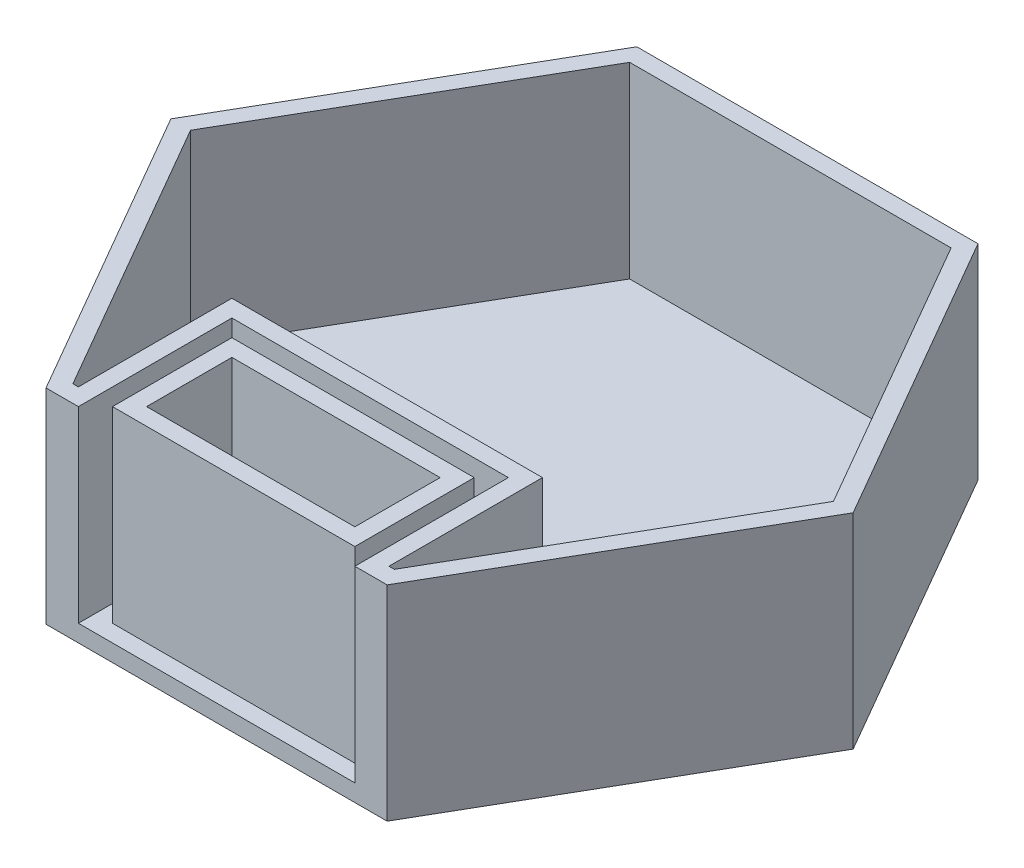
ISO-10303-21;
HEADER;
FILE_DESCRIPTION(('STEP AP214'),'2;1');
FILE_NAME('part.step','',(''),(''),'','','');
FILE_SCHEMA(('AUTOMOTIVE_DESIGN { 1 0 10303 214 1 1 1 1 }'));
ENDSEC;
DATA;
#1=APPLICATION_CONTEXT('core data for automotive mechanical design processes');
#2=APPLICATION_PROTOCOL_DEFINITION('international standard','automotive_design',2000,#1);
#3=PRODUCT_CONTEXT('',#1,'mechanical');
#4=PRODUCT('Part','Part','',(#3));
#5=PRODUCT_RELATED_PRODUCT_CATEGORY('part','',(#4));
#6=PRODUCT_DEFINITION_FORMATION('','',#4);
#7=PRODUCT_DEFINITION_CONTEXT('part definition',#1,'design');
#8=PRODUCT_DEFINITION('design','',#6,#7);
#9=PRODUCT_DEFINITION_SHAPE('','',#8);
#10=(LENGTH_UNIT() NAMED_UNIT(*) SI_UNIT(.MILLI.,.METRE.));
#11=(NAMED_UNIT(*) PLANE_ANGLE_UNIT() SI_UNIT($,.RADIAN.));
#12=(NAMED_UNIT(*) SI_UNIT($,.STERADIAN.) SOLID_ANGLE_UNIT());
#13=UNCERTAINTY_MEASURE_WITH_UNIT(LENGTH_MEASURE(1.E-05),#10,'distance_accuracy_value','');
#14=(GEOMETRIC_REPRESENTATION_CONTEXT(3) GLOBAL_UNCERTAINTY_ASSIGNED_CONTEXT((#13)) GLOBAL_UNIT_ASSIGNED_CONTEXT((#10,
#11,#12)) REPRESENTATION_CONTEXT('',''));
#15=CARTESIAN_POINT('',(0.,0.,0.));
#16=DIRECTION('',(0.,0.,1.));
#17=DIRECTION('',(1.,0.,0.));
#18=AXIS2_PLACEMENT_3D('',#15,#16,#17);
#19=CARTESIAN_POINT('',(0.,2.54,0.));
#20=DIRECTION('',(0.,1.,0.));
#21=DIRECTION('',(0.,0.,1.));
#22=AXIS2_PLACEMENT_3D('',#19,#20,#21);
#23=PLANE('',#22);
#24=DIRECTION('',(0.,0.,-1.));
#25=VECTOR('',#24,1.);
#26=CARTESIAN_POINT('',(30.2211146594323,2.54,0.));
#27=LINE('',#26,#25);
#28=CARTESIAN_POINT('',(30.2211146594323,2.54000000000001,0.));
#29=VERTEX_POINT('',#28);
#30=CARTESIAN_POINT('',(30.2211146594323,2.54,-22.86));
#31=VERTEX_POINT('',#30);
#32=EDGE_CURVE('E405',#29,#31,#27,.T.);
#33=ORIENTED_EDGE('',*,*,#32,.F.);
#34=DIRECTION('',(1.,0.,0.));
#35=VECTOR('',#34,1.);
#36=CARTESIAN_POINT('',(25.4,2.54,0.));
#37=LINE('',#36,#35);
#38=CARTESIAN_POINT('',(71.3907640755157,2.54,0.));
#39=VERTEX_POINT('',#38);
#40=EDGE_CURVE('E473',#29,#39,#37,.T.);
#41=ORIENTED_EDGE('',*,*,#40,.T.);
#42=DIRECTION('',(0.,0.,-1.));
#43=VECTOR('',#42,1.);
#44=CARTESIAN_POINT('',(71.3907640755157,2.54,0.));
#45=LINE('',#44,#43);
#46=CARTESIAN_POINT('',(71.3907640755157,2.54,-22.86));
#47=VERTEX_POINT('',#46);
#48=EDGE_CURVE('E97',#39,#47,#45,.T.);
#49=ORIENTED_EDGE('',*,*,#48,.T.);
#50=DIRECTION('',(-1.,0.,0.));
#51=VECTOR('',#50,1.);
#52=CARTESIAN_POINT('',(0.,2.54,-22.86));
#53=LINE('',#52,#51);
#54=EDGE_CURVE('E92',#47,#31,#53,.T.);
#55=ORIENTED_EDGE('',*,*,#54,.T.);
#56=EDGE_LOOP('',(#33,#41,#49,#55));
#57=FACE_BOUND('',#56,.T.);
#58=DIRECTION('',(-1.,0.,0.));
#59=VECTOR('',#58,1.);
#60=CARTESIAN_POINT('',(0.,2.54,-20.32));
#61=LINE('',#60,#59);
#62=CARTESIAN_POINT('',(68.8507640755157,2.54000000000001,-20.32));
#63=VERTEX_POINT('',#62);
#64=CARTESIAN_POINT('',(32.7611146594323,2.54,-20.32));
#65=VERTEX_POINT('',#64);
#66=EDGE_CURVE('E462',#63,#65,#61,.T.);
#67=ORIENTED_EDGE('',*,*,#66,.F.);
#68=DIRECTION('',(0.,0.,-1.));
#69=VECTOR('',#68,1.);
#70=CARTESIAN_POINT('',(68.8507640755157,2.54,0.));
#71=LINE('',#70,#69);
#72=CARTESIAN_POINT('',(68.8507640755157,2.54,-2.54));
#73=VERTEX_POINT('',#72);
#74=EDGE_CURVE('E455',#73,#63,#71,.T.);
#75=ORIENTED_EDGE('',*,*,#74,.F.);
#76=DIRECTION('',(-1.,0.,0.));
#77=VECTOR('',#76,1.);
#78=CARTESIAN_POINT('',(0.,2.54,-2.54));
#79=LINE('',#78,#77);
#80=CARTESIAN_POINT('',(32.7611146594323,2.54,-2.54));
#81=VERTEX_POINT('',#80);
#82=EDGE_CURVE('E458',#73,#81,#79,.T.);
#83=ORIENTED_EDGE('',*,*,#82,.T.);
#84=DIRECTION('',(0.,0.,-1.));
#85=VECTOR('',#84,1.);
#86=CARTESIAN_POINT('',(32.7611146594323,2.54,0.));
#87=LINE('',#86,#85);
#88=EDGE_CURVE('E460',#81,#65,#87,.T.);
#89=ORIENTED_EDGE('',*,*,#88,.T.);
#90=EDGE_LOOP('',(#67,#75,#83,#89));
#91=FACE_BOUND('',#90,.T.);
#92=ADVANCED_FACE('F77',(#57,#91),#23,.T.);
#93=CARTESIAN_POINT('',(25.4,2.54,0.));
#94=DIRECTION('',(0.,0.,-1.));
#95=DIRECTION('',(-1.,0.,0.));
#96=AXIS2_PLACEMENT_3D('',#93,#94,#95);
#97=PLANE('',#96);
#98=DIRECTION('',(0.,-1.,0.));
#99=VECTOR('',#98,1.);
#100=CARTESIAN_POINT('',(76.2,2.54,0.));
#101=LINE('',#100,#99);
#102=CARTESIAN_POINT('',(76.2,30.48,0.));
#103=VERTEX_POINT('',#102);
#104=CARTESIAN_POINT('',(76.2,0.,0.));
#105=VERTEX_POINT('',#104);
#106=EDGE_CURVE('E12',#103,#105,#101,.T.);
#107=ORIENTED_EDGE('',*,*,#106,.F.);
#108=DIRECTION('',(1.,0.,0.));
#109=VECTOR('',#108,1.);
#110=CARTESIAN_POINT('',(0.,30.48,0.));
#111=LINE('',#110,#109);
#112=CARTESIAN_POINT('',(71.3907640755157,30.48,0.));
#113=VERTEX_POINT('',#112);
#114=EDGE_CURVE('E320',#113,#103,#111,.T.);
#115=ORIENTED_EDGE('',*,*,#114,.F.);
#116=DIRECTION('',(0.,-1.,0.));
#117=VECTOR('',#116,1.);
#118=CARTESIAN_POINT('',(71.3907640755157,30.48,0.));
#119=LINE('',#118,#117);
#120=EDGE_CURVE('E344',#113,#39,#119,.T.);
#121=ORIENTED_EDGE('',*,*,#120,.T.);
#122=ORIENTED_EDGE('',*,*,#40,.F.);
#123=DIRECTION('',(0.,-1.,0.));
#124=VECTOR('',#123,1.);
#125=CARTESIAN_POINT('',(30.2211146594323,30.48,0.));
#126=LINE('',#125,#124);
#127=CARTESIAN_POINT('',(30.2211146594323,30.48,0.));
#128=VERTEX_POINT('',#127);
#129=EDGE_CURVE('E272',#128,#29,#126,.T.);
#130=ORIENTED_EDGE('',*,*,#129,.F.);
#131=DIRECTION('',(-1.,0.,0.));
#132=VECTOR('',#131,1.);
#133=CARTESIAN_POINT('',(0.,30.48,0.));
#134=LINE('',#133,#132);
#135=CARTESIAN_POINT('',(25.4,30.48,0.));
#136=VERTEX_POINT('',#135);
#137=EDGE_CURVE('E338',#128,#136,#134,.T.);
#138=ORIENTED_EDGE('',*,*,#137,.T.);
#139=DIRECTION('',(0.,-1.,0.));
#140=VECTOR('',#139,1.);
#141=CARTESIAN_POINT('',(25.4,2.54,0.));
#142=LINE('',#141,#140);
#143=CARTESIAN_POINT('',(25.4,0.,0.));
#144=VERTEX_POINT('',#143);
#145=EDGE_CURVE('E475',#136,#144,#142,.T.);
#146=ORIENTED_EDGE('',*,*,#145,.T.);
#147=DIRECTION('',(1.,0.,0.));
#148=VECTOR('',#147,1.);
#149=CARTESIAN_POINT('',(25.4,0.,0.));
#150=LINE('',#149,#148);
#151=EDGE_CURVE('E472',#144,#105,#150,.T.);
#152=ORIENTED_EDGE('',*,*,#151,.T.);
#153=EDGE_LOOP('',(#107,#115,#121,#122,#130,#138,#146,#152));
#154=FACE_BOUND('',#153,.T.);
#155=ADVANCED_FACE('F79',(#154),#97,.F.);
#156=CARTESIAN_POINT('',(76.2,2.54,0.));
#157=DIRECTION('',(-0.866025403784439,0.,-0.499999999999999));
#158=DIRECTION('',(-0.499999999999999,0.,0.866025403784439));
#159=AXIS2_PLACEMENT_3D('',#156,#157,#158);
#160=PLANE('',#159);
#161=DIRECTION('',(0.5,0.,-0.866025403784439));
#162=VECTOR('',#161,1.);
#163=CARTESIAN_POINT('',(76.2,0.,0.));
#164=LINE('',#163,#162);
#165=CARTESIAN_POINT('',(101.6,0.,-43.9940905122495));
#166=VERTEX_POINT('',#165);
#167=EDGE_CURVE('E478',#105,#166,#164,.T.);
#168=ORIENTED_EDGE('',*,*,#167,.T.);
#169=DIRECTION('',(0.,-1.,0.));
#170=VECTOR('',#169,1.);
#171=CARTESIAN_POINT('',(101.6,2.54,-43.9940905122495));
#172=LINE('',#171,#170);
#173=CARTESIAN_POINT('',(101.6,30.48,-43.9940905122495));
#174=VERTEX_POINT('',#173);
#175=EDGE_CURVE('E85',#174,#166,#172,.T.);
#176=ORIENTED_EDGE('',*,*,#175,.F.);
#177=DIRECTION('',(0.5,0.,-0.866025403784439));
#178=VECTOR('',#177,1.);
#179=CARTESIAN_POINT('',(57.15,30.48,32.9955678841871));
#180=LINE('',#179,#178);
#181=EDGE_CURVE('E323',#103,#174,#180,.T.);
#182=ORIENTED_EDGE('',*,*,#181,.F.);
#183=ORIENTED_EDGE('',*,*,#106,.T.);
#184=EDGE_LOOP('',(#168,#176,#182,#183));
#185=FACE_BOUND('',#184,.T.);
#186=ADVANCED_FACE('F519',(#185),#160,.F.);
#187=CARTESIAN_POINT('',(101.6,2.54,-43.9940905122495));
#188=DIRECTION('',(-0.866025403784439,0.,0.5));
#189=DIRECTION('',(0.5,0.,0.866025403784439));
#190=AXIS2_PLACEMENT_3D('',#187,#188,#189);
#191=PLANE('',#190);
#192=DIRECTION('',(-0.5,0.,-0.866025403784439));
#193=VECTOR('',#192,1.);
#194=CARTESIAN_POINT('',(101.6,0.,-43.9940905122495));
#195=LINE('',#194,#193);
#196=CARTESIAN_POINT('',(76.1999999999999,0.,-87.988181024499));
#197=VERTEX_POINT('',#196);
#198=EDGE_CURVE('E480',#166,#197,#195,.T.);
#199=ORIENTED_EDGE('',*,*,#198,.T.);
#200=DIRECTION('',(0.,-1.,0.));
#201=VECTOR('',#200,1.);
#202=CARTESIAN_POINT('',(76.1999999999999,2.54,-87.988181024499));
#203=LINE('',#202,#201);
#204=CARTESIAN_POINT('',(76.1999999999999,30.48,-87.988181024499));
#205=VERTEX_POINT('',#204);
#206=EDGE_CURVE('E495',#205,#197,#203,.T.);
#207=ORIENTED_EDGE('',*,*,#206,.F.);
#208=DIRECTION('',(-0.5,0.,-0.866025403784439));
#209=VECTOR('',#208,1.);
#210=CARTESIAN_POINT('',(95.2499999999999,30.48,-54.9926131403118));
#211=LINE('',#210,#209);
#212=EDGE_CURVE('E326',#174,#205,#211,.T.);
#213=ORIENTED_EDGE('',*,*,#212,.F.);
#214=ORIENTED_EDGE('',*,*,#175,.T.);
#215=EDGE_LOOP('',(#199,#207,#213,#214));
#216=FACE_BOUND('',#215,.T.);
#217=ADVANCED_FACE('F501',(#216),#191,.F.);
#218=CARTESIAN_POINT('',(76.1999999999999,2.54,-87.988181024499));
#219=DIRECTION('',(0.,0.,1.));
#220=DIRECTION('',(1.,0.,0.));
#221=AXIS2_PLACEMENT_3D('',#218,#219,#220);
#222=PLANE('',#221);
#223=DIRECTION('',(-1.,0.,0.));
#224=VECTOR('',#223,1.);
#225=CARTESIAN_POINT('',(76.1999999999999,0.,-87.988181024499));
#226=LINE('',#225,#224);
#227=CARTESIAN_POINT('',(25.4,0.,-87.988181024499));
#228=VERTEX_POINT('',#227);
#229=EDGE_CURVE('E482',#197,#228,#226,.T.);
#230=ORIENTED_EDGE('',*,*,#229,.T.);
#231=DIRECTION('',(0.,-1.,0.));
#232=VECTOR('',#231,1.);
#233=CARTESIAN_POINT('',(25.4,2.54,-87.988181024499));
#234=LINE('',#233,#232);
#235=CARTESIAN_POINT('',(25.4,30.48,-87.988181024499));
#236=VERTEX_POINT('',#235);
#237=EDGE_CURVE('E492',#236,#228,#234,.T.);
#238=ORIENTED_EDGE('',*,*,#237,.F.);
#239=DIRECTION('',(-1.,0.,0.));
#240=VECTOR('',#239,1.);
#241=CARTESIAN_POINT('',(0.,30.48,-87.988181024499));
#242=LINE('',#241,#240);
#243=EDGE_CURVE('E329',#205,#236,#242,.T.);
#244=ORIENTED_EDGE('',*,*,#243,.F.);
#245=ORIENTED_EDGE('',*,*,#206,.T.);
#246=EDGE_LOOP('',(#230,#238,#244,#245));
#247=FACE_BOUND('',#246,.T.);
#248=ADVANCED_FACE('F512',(#247),#222,.F.);
#249=CARTESIAN_POINT('',(25.4,2.54,-87.988181024499));
#250=DIRECTION('',(0.866025403784439,0.,0.5));
#251=DIRECTION('',(0.5,0.,-0.866025403784439));
#252=AXIS2_PLACEMENT_3D('',#249,#250,#251);
#253=PLANE('',#252);
#254=DIRECTION('',(-0.5,0.,0.866025403784439));
#255=VECTOR('',#254,1.);
#256=CARTESIAN_POINT('',(25.4,0.,-87.988181024499));
#257=LINE('',#256,#255);
#258=CARTESIAN_POINT('',(0.,0.,-43.9940905122495));
#259=VERTEX_POINT('',#258);
#260=EDGE_CURVE('E484',#228,#259,#257,.T.);
#261=ORIENTED_EDGE('',*,*,#260,.T.);
#262=DIRECTION('',(0.,-1.,0.));
#263=VECTOR('',#262,1.);
#264=CARTESIAN_POINT('',(0.,2.54,-43.9940905122495));
#265=LINE('',#264,#263);
#266=CARTESIAN_POINT('',(0.,30.48,-43.9940905122495));
#267=VERTEX_POINT('',#266);
#268=EDGE_CURVE('E489',#267,#259,#265,.T.);
#269=ORIENTED_EDGE('',*,*,#268,.F.);
#270=DIRECTION('',(-0.5,0.,0.866025403784439));
#271=VECTOR('',#270,1.);
#272=CARTESIAN_POINT('',(-19.05,30.48,-10.9985226280624));
#273=LINE('',#272,#271);
#274=EDGE_CURVE('E332',#236,#267,#273,.T.);
#275=ORIENTED_EDGE('',*,*,#274,.F.);
#276=ORIENTED_EDGE('',*,*,#237,.T.);
#277=EDGE_LOOP('',(#261,#269,#275,#276));
#278=FACE_BOUND('',#277,.T.);
#279=ADVANCED_FACE('F516',(#278),#253,.F.);
#280=CARTESIAN_POINT('',(0.,2.54,-43.9940905122495));
#281=DIRECTION('',(0.866025403784439,0.,-0.5));
#282=DIRECTION('',(-0.5,0.,-0.866025403784439));
#283=AXIS2_PLACEMENT_3D('',#280,#281,#282);
#284=PLANE('',#283);
#285=DIRECTION('',(0.5,0.,0.866025403784439));
#286=VECTOR('',#285,1.);
#287=CARTESIAN_POINT('',(0.,0.,-43.9940905122495));
#288=LINE('',#287,#286);
#289=EDGE_CURVE('E476',#259,#144,#288,.T.);
#290=ORIENTED_EDGE('',*,*,#289,.T.);
#291=ORIENTED_EDGE('',*,*,#145,.F.);
#292=DIRECTION('',(0.5,0.,0.866025403784439));
#293=VECTOR('',#292,1.);
#294=CARTESIAN_POINT('',(19.05,30.48,-10.9985226280624));
#295=LINE('',#294,#293);
#296=EDGE_CURVE('E335',#267,#136,#295,.T.);
#297=ORIENTED_EDGE('',*,*,#296,.F.);
#298=ORIENTED_EDGE('',*,*,#268,.T.);
#299=EDGE_LOOP('',(#290,#291,#297,#298));
#300=FACE_BOUND('',#299,.T.);
#301=ADVANCED_FACE('F522',(#300),#284,.F.);
#302=CARTESIAN_POINT('',(0.,0.,0.));
#303=DIRECTION('',(0.,1.,0.));
#304=DIRECTION('',(0.,0.,1.));
#305=AXIS2_PLACEMENT_3D('',#302,#303,#304);
#306=PLANE('',#305);
#307=ORIENTED_EDGE('',*,*,#167,.F.);
#308=ORIENTED_EDGE('',*,*,#151,.F.);
#309=ORIENTED_EDGE('',*,*,#289,.F.);
#310=ORIENTED_EDGE('',*,*,#260,.F.);
#311=ORIENTED_EDGE('',*,*,#229,.F.);
#312=ORIENTED_EDGE('',*,*,#198,.F.);
#313=EDGE_LOOP('',(#307,#308,#309,#310,#311,#312));
#314=FACE_BOUND('',#313,.T.);
#315=ADVANCED_FACE('F507',(#314),#306,.F.);
#316=CARTESIAN_POINT('',(0.,30.48,-17.78));
#317=DIRECTION('',(0.,0.,-1.));
#318=DIRECTION('',(-1.,0.,0.));
#319=AXIS2_PLACEMENT_3D('',#316,#317,#318);
#320=PLANE('',#319);
#321=DIRECTION('',(-1.,0.,0.));
#322=VECTOR('',#321,1.);
#323=CARTESIAN_POINT('',(0.,2.54,-17.78));
#324=LINE('',#323,#322);
#325=CARTESIAN_POINT('',(66.3107640755157,2.54,-17.78));
#326=VERTEX_POINT('',#325);
#327=CARTESIAN_POINT('',(35.3011146594323,2.54000000000001,-17.78));
#328=VERTEX_POINT('',#327);
#329=EDGE_CURVE('E470',#326,#328,#324,.T.);
#330=ORIENTED_EDGE('',*,*,#329,.F.);
#331=DIRECTION('',(0.,-1.,0.));
#332=VECTOR('',#331,1.);
#333=CARTESIAN_POINT('',(66.3107640755157,30.48,-17.78));
#334=LINE('',#333,#332);
#335=CARTESIAN_POINT('',(66.3107640755157,30.48,-17.78));
#336=VERTEX_POINT('',#335);
#337=EDGE_CURVE('E439',#336,#326,#334,.T.);
#338=ORIENTED_EDGE('',*,*,#337,.F.);
#339=DIRECTION('',(1.,0.,0.));
#340=VECTOR('',#339,1.);
#341=CARTESIAN_POINT('',(0.,30.48,-17.78));
#342=LINE('',#341,#340);
#343=CARTESIAN_POINT('',(35.3011146594323,30.48,-17.78));
#344=VERTEX_POINT('',#343);
#345=EDGE_CURVE('E417',#344,#336,#342,.T.);
#346=ORIENTED_EDGE('',*,*,#345,.F.);
#347=DIRECTION('',(0.,-1.,0.));
#348=VECTOR('',#347,1.);
#349=CARTESIAN_POINT('',(35.3011146594323,30.48,-17.78));
#350=LINE('',#349,#348);
#351=EDGE_CURVE('E429',#344,#328,#350,.T.);
#352=ORIENTED_EDGE('',*,*,#351,.T.);
#353=EDGE_LOOP('',(#330,#338,#346,#352));
#354=FACE_BOUND('',#353,.T.);
#355=ADVANCED_FACE('F609',(#354),#320,.F.);
#356=CARTESIAN_POINT('',(66.3107640755157,30.48,0.));
#357=DIRECTION('',(1.,0.,0.));
#358=DIRECTION('',(0.,0.,-1.));
#359=AXIS2_PLACEMENT_3D('',#356,#357,#358);
#360=PLANE('',#359);
#361=DIRECTION('',(0.,0.,-1.));
#362=VECTOR('',#361,1.);
#363=CARTESIAN_POINT('',(66.3107640755157,2.54,0.));
#364=LINE('',#363,#362);
#365=CARTESIAN_POINT('',(66.3107640755157,2.54,-5.08));
#366=VERTEX_POINT('',#365);
#367=EDGE_CURVE('E468',#366,#326,#364,.T.);
#368=ORIENTED_EDGE('',*,*,#367,.F.);
#369=DIRECTION('',(0.,-1.,0.));
#370=VECTOR('',#369,1.);
#371=CARTESIAN_POINT('',(66.3107640755157,30.48,-5.08));
#372=LINE('',#371,#370);
#373=CARTESIAN_POINT('',(66.3107640755157,30.48,-5.08));
#374=VERTEX_POINT('',#373);
#375=EDGE_CURVE('E436',#374,#366,#372,.T.);
#376=ORIENTED_EDGE('',*,*,#375,.F.);
#377=DIRECTION('',(0.,0.,1.));
#378=VECTOR('',#377,1.);
#379=CARTESIAN_POINT('',(66.3107640755157,30.48,0.));
#380=LINE('',#379,#378);
#381=EDGE_CURVE('E420',#336,#374,#380,.T.);
#382=ORIENTED_EDGE('',*,*,#381,.F.);
#383=ORIENTED_EDGE('',*,*,#337,.T.);
#384=EDGE_LOOP('',(#368,#376,#382,#383));
#385=FACE_BOUND('',#384,.T.);
#386=ADVANCED_FACE('F605',(#385),#360,.F.);
#387=CARTESIAN_POINT('',(0.,30.48,-5.08));
#388=DIRECTION('',(0.,0.,-1.));
#389=DIRECTION('',(-1.,0.,0.));
#390=AXIS2_PLACEMENT_3D('',#387,#388,#389);
#391=PLANE('',#390);
#392=ORIENTED_EDGE('',*,*,#375,.T.);
#393=DIRECTION('',(-1.,0.,0.));
#394=VECTOR('',#393,1.);
#395=CARTESIAN_POINT('',(0.,2.54,-5.08));
#396=LINE('',#395,#394);
#397=CARTESIAN_POINT('',(35.3011146594323,2.54,-5.08));
#398=VERTEX_POINT('',#397);
#399=EDGE_CURVE('E465',#366,#398,#396,.T.);
#400=ORIENTED_EDGE('',*,*,#399,.T.);
#401=DIRECTION('',(0.,-1.,0.));
#402=VECTOR('',#401,1.);
#403=CARTESIAN_POINT('',(35.3011146594323,30.48,-5.08));
#404=LINE('',#403,#402);
#405=CARTESIAN_POINT('',(35.3011146594323,30.48,-5.08));
#406=VERTEX_POINT('',#405);
#407=EDGE_CURVE('E432',#406,#398,#404,.T.);
#408=ORIENTED_EDGE('',*,*,#407,.F.);
#409=DIRECTION('',(1.,0.,0.));
#410=VECTOR('',#409,1.);
#411=CARTESIAN_POINT('',(0.,30.48,-5.08));
#412=LINE('',#411,#410);
#413=EDGE_CURVE('E422',#406,#374,#412,.T.);
#414=ORIENTED_EDGE('',*,*,#413,.T.);
#415=EDGE_LOOP('',(#392,#400,#408,#414));
#416=FACE_BOUND('',#415,.T.);
#417=ADVANCED_FACE('F601',(#416),#391,.T.);
#418=CARTESIAN_POINT('',(0.,30.48,-20.32));
#419=DIRECTION('',(0.,0.,-1.));
#420=DIRECTION('',(-1.,0.,0.));
#421=AXIS2_PLACEMENT_3D('',#418,#419,#420);
#422=PLANE('',#421);
#423=DIRECTION('',(0.,-1.,0.));
#424=VECTOR('',#423,1.);
#425=CARTESIAN_POINT('',(68.8507640755157,30.48,-20.32));
#426=LINE('',#425,#424);
#427=CARTESIAN_POINT('',(68.8507640755157,30.48,-20.32));
#428=VERTEX_POINT('',#427);
#429=EDGE_CURVE('E428',#428,#63,#426,.T.);
#430=ORIENTED_EDGE('',*,*,#429,.T.);
#431=ORIENTED_EDGE('',*,*,#66,.T.);
#432=DIRECTION('',(0.,-1.,0.));
#433=VECTOR('',#432,1.);
#434=CARTESIAN_POINT('',(32.7611146594323,30.48,-20.32));
#435=LINE('',#434,#433);
#436=CARTESIAN_POINT('',(32.7611146594323,30.48,-20.32));
#437=VERTEX_POINT('',#436);
#438=EDGE_CURVE('E433',#437,#65,#435,.T.);
#439=ORIENTED_EDGE('',*,*,#438,.F.);
#440=DIRECTION('',(1.,0.,0.));
#441=VECTOR('',#440,1.);
#442=CARTESIAN_POINT('',(0.,30.48,-20.32));
#443=LINE('',#442,#441);
#444=EDGE_CURVE('E407',#437,#428,#443,.T.);
#445=ORIENTED_EDGE('',*,*,#444,.T.);
#446=EDGE_LOOP('',(#430,#431,#439,#445));
#447=FACE_BOUND('',#446,.T.);
#448=ADVANCED_FACE('F604',(#447),#422,.T.);
#449=CARTESIAN_POINT('',(32.7611146594323,30.48,0.));
#450=DIRECTION('',(1.,0.,0.));
#451=DIRECTION('',(0.,0.,-1.));
#452=AXIS2_PLACEMENT_3D('',#449,#450,#451);
#453=PLANE('',#452);
#454=ORIENTED_EDGE('',*,*,#88,.F.);
#455=DIRECTION('',(0.,-1.,0.));
#456=VECTOR('',#455,1.);
#457=CARTESIAN_POINT('',(32.7611146594323,30.48,-2.54));
#458=LINE('',#457,#456);
#459=CARTESIAN_POINT('',(32.7611146594323,30.48,-2.54));
#460=VERTEX_POINT('',#459);
#461=EDGE_CURVE('E448',#460,#81,#458,.T.);
#462=ORIENTED_EDGE('',*,*,#461,.F.);
#463=DIRECTION('',(0.,0.,1.));
#464=VECTOR('',#463,1.);
#465=CARTESIAN_POINT('',(32.7611146594323,30.48,0.));
#466=LINE('',#465,#464);
#467=EDGE_CURVE('E410',#437,#460,#466,.T.);
#468=ORIENTED_EDGE('',*,*,#467,.F.);
#469=ORIENTED_EDGE('',*,*,#438,.T.);
#470=EDGE_LOOP('',(#454,#462,#468,#469));
#471=FACE_BOUND('',#470,.T.);
#472=ADVANCED_FACE('F620',(#471),#453,.F.);
#473=CARTESIAN_POINT('',(0.,30.48,-2.54));
#474=DIRECTION('',(0.,0.,-1.));
#475=DIRECTION('',(-1.,0.,0.));
#476=AXIS2_PLACEMENT_3D('',#473,#474,#475);
#477=PLANE('',#476);
#478=ORIENTED_EDGE('',*,*,#82,.F.);
#479=DIRECTION('',(0.,-1.,0.));
#480=VECTOR('',#479,1.);
#481=CARTESIAN_POINT('',(68.8507640755157,30.48,-2.54));
#482=LINE('',#481,#480);
#483=CARTESIAN_POINT('',(68.8507640755157,30.48,-2.54));
#484=VERTEX_POINT('',#483);
#485=EDGE_CURVE('E445',#484,#73,#482,.T.);
#486=ORIENTED_EDGE('',*,*,#485,.F.);
#487=DIRECTION('',(1.,0.,0.));
#488=VECTOR('',#487,1.);
#489=CARTESIAN_POINT('',(0.,30.48,-2.54));
#490=LINE('',#489,#488);
#491=EDGE_CURVE('E412',#460,#484,#490,.T.);
#492=ORIENTED_EDGE('',*,*,#491,.F.);
#493=ORIENTED_EDGE('',*,*,#461,.T.);
#494=EDGE_LOOP('',(#478,#486,#492,#493));
#495=FACE_BOUND('',#494,.T.);
#496=ADVANCED_FACE('F616',(#495),#477,.F.);
#497=CARTESIAN_POINT('',(68.8507640755157,30.48,0.));
#498=DIRECTION('',(1.,0.,0.));
#499=DIRECTION('',(0.,0.,-1.));
#500=AXIS2_PLACEMENT_3D('',#497,#498,#499);
#501=PLANE('',#500);
#502=ORIENTED_EDGE('',*,*,#485,.T.);
#503=ORIENTED_EDGE('',*,*,#74,.T.);
#504=ORIENTED_EDGE('',*,*,#429,.F.);
#505=DIRECTION('',(0.,0.,1.));
#506=VECTOR('',#505,1.);
#507=CARTESIAN_POINT('',(68.8507640755157,30.48,0.));
#508=LINE('',#507,#506);
#509=EDGE_CURVE('E414',#428,#484,#508,.T.);
#510=ORIENTED_EDGE('',*,*,#509,.T.);
#511=EDGE_LOOP('',(#502,#503,#504,#510));
#512=FACE_BOUND('',#511,.T.);
#513=ADVANCED_FACE('F599',(#512),#501,.T.);
#514=CARTESIAN_POINT('',(35.3011146594323,30.48,0.));
#515=DIRECTION('',(1.,0.,0.));
#516=DIRECTION('',(0.,0.,-1.));
#517=AXIS2_PLACEMENT_3D('',#514,#515,#516);
#518=PLANE('',#517);
#519=ORIENTED_EDGE('',*,*,#407,.T.);
#520=DIRECTION('',(0.,0.,-1.));
#521=VECTOR('',#520,1.);
#522=CARTESIAN_POINT('',(35.3011146594323,2.54,0.));
#523=LINE('',#522,#521);
#524=EDGE_CURVE('E442',#398,#328,#523,.T.);
#525=ORIENTED_EDGE('',*,*,#524,.T.);
#526=ORIENTED_EDGE('',*,*,#351,.F.);
#527=DIRECTION('',(0.,0.,1.));
#528=VECTOR('',#527,1.);
#529=CARTESIAN_POINT('',(35.3011146594323,30.48,0.));
#530=LINE('',#529,#528);
#531=EDGE_CURVE('E425',#344,#406,#530,.T.);
#532=ORIENTED_EDGE('',*,*,#531,.T.);
#533=EDGE_LOOP('',(#519,#525,#526,#532));
#534=FACE_BOUND('',#533,.T.);
#535=ADVANCED_FACE('F595',(#534),#518,.T.);
#536=CARTESIAN_POINT('',(0.,30.48,0.));
#537=DIRECTION('',(0.,1.,0.));
#538=DIRECTION('',(0.,0.,1.));
#539=AXIS2_PLACEMENT_3D('',#536,#537,#538);
#540=PLANE('',#539);
#541=ORIENTED_EDGE('',*,*,#444,.F.);
#542=ORIENTED_EDGE('',*,*,#467,.T.);
#543=ORIENTED_EDGE('',*,*,#491,.T.);
#544=ORIENTED_EDGE('',*,*,#509,.F.);
#545=EDGE_LOOP('',(#541,#542,#543,#544));
#546=FACE_BOUND('',#545,.T.);
#547=ORIENTED_EDGE('',*,*,#345,.T.);
#548=ORIENTED_EDGE('',*,*,#381,.T.);
#549=ORIENTED_EDGE('',*,*,#413,.F.);
#550=ORIENTED_EDGE('',*,*,#531,.F.);
#551=EDGE_LOOP('',(#547,#548,#549,#550));
#552=FACE_BOUND('',#551,.T.);
#553=ADVANCED_FACE('F554',(#546,#552),#540,.T.);
#554=ORIENTED_EDGE('',*,*,#367,.T.);
#555=ORIENTED_EDGE('',*,*,#329,.T.);
#556=ORIENTED_EDGE('',*,*,#524,.F.);
#557=ORIENTED_EDGE('',*,*,#399,.F.);
#558=EDGE_LOOP('',(#554,#555,#556,#557));
#559=FACE_BOUND('',#558,.T.);
#560=ADVANCED_FACE('F544',(#559),#23,.T.);
#561=CARTESIAN_POINT('',(30.2211146594323,30.48,0.));
#562=DIRECTION('',(1.,0.,0.));
#563=DIRECTION('',(0.,0.,-1.));
#564=AXIS2_PLACEMENT_3D('',#561,#562,#563);
#565=PLANE('',#564);
#566=ORIENTED_EDGE('',*,*,#129,.T.);
#567=ORIENTED_EDGE('',*,*,#32,.T.);
#568=DIRECTION('',(0.,-1.,0.));
#569=VECTOR('',#568,1.);
#570=CARTESIAN_POINT('',(30.2211146594323,30.48,-22.86));
#571=LINE('',#570,#569);
#572=CARTESIAN_POINT('',(30.2211146594323,30.48,-22.86));
#573=VERTEX_POINT('',#572);
#574=EDGE_CURVE('E350',#573,#31,#571,.T.);
#575=ORIENTED_EDGE('',*,*,#574,.F.);
#576=DIRECTION('',(0.,0.,1.));
#577=VECTOR('',#576,1.);
#578=CARTESIAN_POINT('',(30.2211146594323,30.48,0.));
#579=LINE('',#578,#577);
#580=EDGE_CURVE('E311',#573,#128,#579,.T.);
#581=ORIENTED_EDGE('',*,*,#580,.T.);
#582=EDGE_LOOP('',(#566,#567,#575,#581));
#583=FACE_BOUND('',#582,.T.);
#584=ADVANCED_FACE('F525',(#583),#565,.T.);
#585=CARTESIAN_POINT('',(0.,30.48,-22.86));
#586=DIRECTION('',(0.,0.,-1.));
#587=DIRECTION('',(-1.,0.,0.));
#588=AXIS2_PLACEMENT_3D('',#585,#586,#587);
#589=PLANE('',#588);
#590=ORIENTED_EDGE('',*,*,#54,.F.);
#591=DIRECTION('',(0.,-1.,0.));
#592=VECTOR('',#591,1.);
#593=CARTESIAN_POINT('',(71.3907640755157,30.48,-22.86));
#594=LINE('',#593,#592);
#595=CARTESIAN_POINT('',(71.3907640755157,30.48,-22.86));
#596=VERTEX_POINT('',#595);
#597=EDGE_CURVE('E347',#596,#47,#594,.T.);
#598=ORIENTED_EDGE('',*,*,#597,.F.);
#599=DIRECTION('',(1.,0.,0.));
#600=VECTOR('',#599,1.);
#601=CARTESIAN_POINT('',(0.,30.48,-22.86));
#602=LINE('',#601,#600);
#603=EDGE_CURVE('E314',#573,#596,#602,.T.);
#604=ORIENTED_EDGE('',*,*,#603,.F.);
#605=ORIENTED_EDGE('',*,*,#574,.T.);
#606=EDGE_LOOP('',(#590,#598,#604,#605));
#607=FACE_BOUND('',#606,.T.);
#608=ADVANCED_FACE('F530',(#607),#589,.F.);
#609=CARTESIAN_POINT('',(71.3907640755157,30.48,0.));
#610=DIRECTION('',(1.,0.,0.));
#611=DIRECTION('',(0.,0.,-1.));
#612=AXIS2_PLACEMENT_3D('',#609,#610,#611);
#613=PLANE('',#612);
#614=ORIENTED_EDGE('',*,*,#48,.F.);
#615=ORIENTED_EDGE('',*,*,#120,.F.);
#616=DIRECTION('',(0.,0.,1.));
#617=VECTOR('',#616,1.);
#618=CARTESIAN_POINT('',(71.3907640755157,30.48,0.));
#619=LINE('',#618,#617);
#620=EDGE_CURVE('E317',#596,#113,#619,.T.);
#621=ORIENTED_EDGE('',*,*,#620,.F.);
#622=ORIENTED_EDGE('',*,*,#597,.T.);
#623=EDGE_LOOP('',(#614,#615,#621,#622));
#624=FACE_BOUND('',#623,.T.);
#625=ADVANCED_FACE('F532',(#624),#613,.F.);
#626=CARTESIAN_POINT('',(0.,30.48,-2.54));
#627=DIRECTION('',(0.,0.,-1.));
#628=DIRECTION('',(-1.,0.,0.));
#629=AXIS2_PLACEMENT_3D('',#626,#627,#628);
#630=PLANE('',#629);
#631=DIRECTION('',(0.,-1.,0.));
#632=VECTOR('',#631,1.);
#633=CARTESIAN_POINT('',(74.7335303162583,30.48,-2.53999999999999));
#634=LINE('',#633,#632);
#635=CARTESIAN_POINT('',(74.7335303162583,30.48,-2.53999999999999));
#636=VERTEX_POINT('',#635);
#637=CARTESIAN_POINT('',(74.7335303162583,2.54000000000001,-2.53999999999999));
#638=VERTEX_POINT('',#637);
#639=EDGE_CURVE('E341',#636,#638,#634,.T.);
#640=ORIENTED_EDGE('',*,*,#639,.T.);
#641=DIRECTION('',(-1.,0.,0.));
#642=VECTOR('',#641,1.);
#643=CARTESIAN_POINT('',(0.,2.54,-2.54));
#644=LINE('',#643,#642);
#645=CARTESIAN_POINT('',(73.9307640755157,2.54,-2.54));
#646=VERTEX_POINT('',#645);
#647=EDGE_CURVE('E268',#638,#646,#644,.T.);
#648=ORIENTED_EDGE('',*,*,#647,.T.);
#649=DIRECTION('',(0.,-1.,0.));
#650=VECTOR('',#649,1.);
#651=CARTESIAN_POINT('',(73.9307640755157,30.48,-2.54));
#652=LINE('',#651,#650);
#653=CARTESIAN_POINT('',(73.9307640755157,30.48,-2.54));
#654=VERTEX_POINT('',#653);
#655=EDGE_CURVE('E262',#654,#646,#652,.T.);
#656=ORIENTED_EDGE('',*,*,#655,.F.);
#657=DIRECTION('',(1.,0.,0.));
#658=VECTOR('',#657,1.);
#659=CARTESIAN_POINT('',(0.,30.48,-2.54));
#660=LINE('',#659,#658);
#661=EDGE_CURVE('E266',#654,#636,#660,.T.);
#662=ORIENTED_EDGE('',*,*,#661,.T.);
#663=EDGE_LOOP('',(#640,#648,#656,#662));
#664=FACE_BOUND('',#663,.T.);
#665=ADVANCED_FACE('F265',(#664),#630,.T.);
#666=CARTESIAN_POINT('',(73.9307640755157,30.48,0.));
#667=DIRECTION('',(1.,0.,0.));
#668=DIRECTION('',(0.,0.,-1.));
#669=AXIS2_PLACEMENT_3D('',#666,#667,#668);
#670=PLANE('',#669);
#671=ORIENTED_EDGE('',*,*,#655,.T.);
#672=DIRECTION('',(0.,0.,-1.));
#673=VECTOR('',#672,1.);
#674=CARTESIAN_POINT('',(73.9307640755157,2.54,0.));
#675=LINE('',#674,#673);
#676=CARTESIAN_POINT('',(73.9307640755157,2.54,-25.4));
#677=VERTEX_POINT('',#676);
#678=EDGE_CURVE('E400',#646,#677,#675,.T.);
#679=ORIENTED_EDGE('',*,*,#678,.T.);
#680=DIRECTION('',(0.,-1.,0.));
#681=VECTOR('',#680,1.);
#682=CARTESIAN_POINT('',(73.9307640755157,30.48,-25.4));
#683=LINE('',#682,#681);
#684=CARTESIAN_POINT('',(73.9307640755157,30.48,-25.4));
#685=VERTEX_POINT('',#684);
#686=EDGE_CURVE('E273',#685,#677,#683,.T.);
#687=ORIENTED_EDGE('',*,*,#686,.F.);
#688=DIRECTION('',(0.,0.,1.));
#689=VECTOR('',#688,1.);
#690=CARTESIAN_POINT('',(73.9307640755157,30.48,0.));
#691=LINE('',#690,#689);
#692=EDGE_CURVE('E280',#685,#654,#691,.T.);
#693=ORIENTED_EDGE('',*,*,#692,.T.);
#694=EDGE_LOOP('',(#671,#679,#687,#693));
#695=FACE_BOUND('',#694,.T.);
#696=ADVANCED_FACE('F286',(#695),#670,.T.);
#697=CARTESIAN_POINT('',(0.,30.48,-25.4));
#698=DIRECTION('',(0.,0.,-1.));
#699=DIRECTION('',(-1.,0.,0.));
#700=AXIS2_PLACEMENT_3D('',#697,#698,#699);
#701=PLANE('',#700);
#702=ORIENTED_EDGE('',*,*,#686,.T.);
#703=DIRECTION('',(-1.,0.,0.));
#704=VECTOR('',#703,1.);
#705=CARTESIAN_POINT('',(0.,2.54,-25.4));
#706=LINE('',#705,#704);
#707=CARTESIAN_POINT('',(27.6811146594323,2.54,-25.4));
#708=VERTEX_POINT('',#707);
#709=EDGE_CURVE('E397',#677,#708,#706,.T.);
#710=ORIENTED_EDGE('',*,*,#709,.T.);
#711=DIRECTION('',(0.,-1.,0.));
#712=VECTOR('',#711,1.);
#713=CARTESIAN_POINT('',(27.6811146594323,30.48,-25.4));
#714=LINE('',#713,#712);
#715=CARTESIAN_POINT('',(27.6811146594323,30.48,-25.4));
#716=VERTEX_POINT('',#715);
#717=EDGE_CURVE('E373',#716,#708,#714,.T.);
#718=ORIENTED_EDGE('',*,*,#717,.F.);
#719=DIRECTION('',(1.,0.,0.));
#720=VECTOR('',#719,1.);
#721=CARTESIAN_POINT('',(0.,30.48,-25.4));
#722=LINE('',#721,#720);
#723=EDGE_CURVE('E288',#716,#685,#722,.T.);
#724=ORIENTED_EDGE('',*,*,#723,.T.);
#725=EDGE_LOOP('',(#702,#710,#718,#724));
#726=FACE_BOUND('',#725,.T.);
#727=ADVANCED_FACE('F582',(#726),#701,.T.);
#728=CARTESIAN_POINT('',(27.6811146594323,30.48,0.));
#729=DIRECTION('',(-1.,0.,0.));
#730=DIRECTION('',(0.,0.,1.));
#731=AXIS2_PLACEMENT_3D('',#728,#729,#730);
#732=PLANE('',#731);
#733=ORIENTED_EDGE('',*,*,#717,.T.);
#734=DIRECTION('',(0.,0.,1.));
#735=VECTOR('',#734,1.);
#736=CARTESIAN_POINT('',(27.6811146594323,2.54,0.));
#737=LINE('',#736,#735);
#738=CARTESIAN_POINT('',(27.6811146594323,2.54,-2.54));
#739=VERTEX_POINT('',#738);
#740=EDGE_CURVE('E394',#708,#739,#737,.T.);
#741=ORIENTED_EDGE('',*,*,#740,.T.);
#742=DIRECTION('',(0.,-1.,0.));
#743=VECTOR('',#742,1.);
#744=CARTESIAN_POINT('',(27.6811146594323,30.48,-2.54));
#745=LINE('',#744,#743);
#746=CARTESIAN_POINT('',(27.6811146594323,30.48,-2.54));
#747=VERTEX_POINT('',#746);
#748=EDGE_CURVE('E370',#747,#739,#745,.T.);
#749=ORIENTED_EDGE('',*,*,#748,.F.);
#750=DIRECTION('',(0.,0.,-1.));
#751=VECTOR('',#750,1.);
#752=CARTESIAN_POINT('',(27.6811146594323,30.48,0.));
#753=LINE('',#752,#751);
#754=EDGE_CURVE('E290',#747,#716,#753,.T.);
#755=ORIENTED_EDGE('',*,*,#754,.T.);
#756=EDGE_LOOP('',(#733,#741,#749,#755));
#757=FACE_BOUND('',#756,.T.);
#758=ADVANCED_FACE('F580',(#757),#732,.T.);
#759=CARTESIAN_POINT('',(0.,30.48,-2.54));
#760=DIRECTION('',(0.,0.,-1.));
#761=DIRECTION('',(-1.,0.,0.));
#762=AXIS2_PLACEMENT_3D('',#759,#760,#761);
#763=PLANE('',#762);
#764=ORIENTED_EDGE('',*,*,#748,.T.);
#765=DIRECTION('',(-1.,0.,0.));
#766=VECTOR('',#765,1.);
#767=CARTESIAN_POINT('',(0.,2.54,-2.54));
#768=LINE('',#767,#766);
#769=CARTESIAN_POINT('',(26.8664696837416,2.54,-2.54));
#770=VERTEX_POINT('',#769);
#771=EDGE_CURVE('E391',#739,#770,#768,.T.);
#772=ORIENTED_EDGE('',*,*,#771,.T.);
#773=DIRECTION('',(0.,-1.,0.));
#774=VECTOR('',#773,1.);
#775=CARTESIAN_POINT('',(26.8664696837416,30.48,-2.54));
#776=LINE('',#775,#774);
#777=CARTESIAN_POINT('',(26.8664696837416,30.48,-2.54));
#778=VERTEX_POINT('',#777);
#779=EDGE_CURVE('E367',#778,#770,#776,.T.);
#780=ORIENTED_EDGE('',*,*,#779,.F.);
#781=DIRECTION('',(1.,0.,0.));
#782=VECTOR('',#781,1.);
#783=CARTESIAN_POINT('',(0.,30.48,-2.54));
#784=LINE('',#783,#782);
#785=EDGE_CURVE('E295',#778,#747,#784,.T.);
#786=ORIENTED_EDGE('',*,*,#785,.T.);
#787=EDGE_LOOP('',(#764,#772,#780,#786));
#788=FACE_BOUND('',#787,.T.);
#789=ADVANCED_FACE('F578',(#788),#763,.T.);
#790=CARTESIAN_POINT('',(21.2497045256125,30.48,-12.2685226280624));
#791=DIRECTION('',(0.866025403784438,0.,-0.5));
#792=DIRECTION('',(-0.5,0.,-0.866025403784439));
#793=AXIS2_PLACEMENT_3D('',#790,#791,#792);
#794=PLANE('',#793);
#795=ORIENTED_EDGE('',*,*,#779,.T.);
#796=DIRECTION('',(-0.5,0.,-0.866025403784439));
#797=VECTOR('',#796,1.);
#798=CARTESIAN_POINT('',(21.2497045256125,2.54,-12.2685226280624));
#799=LINE('',#798,#797);
#800=CARTESIAN_POINT('',(2.9329393674833,2.54,-43.9940905122494));
#801=VERTEX_POINT('',#800);
#802=EDGE_CURVE('E388',#770,#801,#799,.T.);
#803=ORIENTED_EDGE('',*,*,#802,.T.);
#804=DIRECTION('',(0.,-1.,0.));
#805=VECTOR('',#804,1.);
#806=CARTESIAN_POINT('',(2.9329393674833,30.48,-43.9940905122494));
#807=LINE('',#806,#805);
#808=CARTESIAN_POINT('',(2.9329393674833,30.48,-43.9940905122494));
#809=VERTEX_POINT('',#808);
#810=EDGE_CURVE('E364',#809,#801,#807,.T.);
#811=ORIENTED_EDGE('',*,*,#810,.F.);
#812=DIRECTION('',(0.5,0.,0.866025403784439));
#813=VECTOR('',#812,1.);
#814=CARTESIAN_POINT('',(21.2497045256125,30.48,-12.2685226280624));
#815=LINE('',#814,#813);
#816=EDGE_CURVE('E298',#809,#778,#815,.T.);
#817=ORIENTED_EDGE('',*,*,#816,.T.);
#818=EDGE_LOOP('',(#795,#803,#811,#817));
#819=FACE_BOUND('',#818,.T.);
#820=ADVANCED_FACE('F574',(#819),#794,.T.);
#821=CARTESIAN_POINT('',(-16.8502954743875,30.48,-9.72852262806233));
#822=DIRECTION('',(0.866025403784439,0.,0.499999999999999));
#823=DIRECTION('',(0.499999999999999,0.,-0.866025403784439));
#824=AXIS2_PLACEMENT_3D('',#821,#822,#823);
#825=PLANE('',#824);
#826=ORIENTED_EDGE('',*,*,#810,.T.);
#827=DIRECTION('',(0.499999999999999,0.,-0.866025403784439));
#828=VECTOR('',#827,1.);
#829=CARTESIAN_POINT('',(-16.8502954743875,2.54,-9.72852262806233));
#830=LINE('',#829,#828);
#831=CARTESIAN_POINT('',(26.8664696837416,2.54,-85.448181024499));
#832=VERTEX_POINT('',#831);
#833=EDGE_CURVE('E385',#801,#832,#830,.T.);
#834=ORIENTED_EDGE('',*,*,#833,.T.);
#835=DIRECTION('',(0.,-1.,0.));
#836=VECTOR('',#835,1.);
#837=CARTESIAN_POINT('',(26.8664696837416,30.48,-85.448181024499));
#838=LINE('',#837,#836);
#839=CARTESIAN_POINT('',(26.8664696837416,30.48,-85.448181024499));
#840=VERTEX_POINT('',#839);
#841=EDGE_CURVE('E361',#840,#832,#838,.T.);
#842=ORIENTED_EDGE('',*,*,#841,.F.);
#843=DIRECTION('',(-0.499999999999999,0.,0.866025403784439));
#844=VECTOR('',#843,1.);
#845=CARTESIAN_POINT('',(-16.8502954743875,30.48,-9.72852262806233));
#846=LINE('',#845,#844);
#847=EDGE_CURVE('E301',#840,#809,#846,.T.);
#848=ORIENTED_EDGE('',*,*,#847,.T.);
#849=EDGE_LOOP('',(#826,#834,#842,#848));
#850=FACE_BOUND('',#849,.T.);
#851=ADVANCED_FACE('F572',(#850),#825,.T.);
#852=CARTESIAN_POINT('',(0.,30.48,-85.448181024499));
#853=DIRECTION('',(0.,0.,1.));
#854=DIRECTION('',(1.,0.,0.));
#855=AXIS2_PLACEMENT_3D('',#852,#853,#854);
#856=PLANE('',#855);
#857=ORIENTED_EDGE('',*,*,#841,.T.);
#858=DIRECTION('',(1.,0.,0.));
#859=VECTOR('',#858,1.);
#860=CARTESIAN_POINT('',(0.,2.54,-85.448181024499));
#861=LINE('',#860,#859);
#862=CARTESIAN_POINT('',(74.7335303162583,2.54,-85.448181024499));
#863=VERTEX_POINT('',#862);
#864=EDGE_CURVE('E382',#832,#863,#861,.T.);
#865=ORIENTED_EDGE('',*,*,#864,.T.);
#866=DIRECTION('',(0.,-1.,0.));
#867=VECTOR('',#866,1.);
#868=CARTESIAN_POINT('',(74.7335303162583,30.48,-85.448181024499));
#869=LINE('',#868,#867);
#870=CARTESIAN_POINT('',(74.7335303162583,30.48,-85.448181024499));
#871=VERTEX_POINT('',#870);
#872=EDGE_CURVE('E358',#871,#863,#869,.T.);
#873=ORIENTED_EDGE('',*,*,#872,.F.);
#874=DIRECTION('',(-1.,0.,0.));
#875=VECTOR('',#874,1.);
#876=CARTESIAN_POINT('',(0.,30.48,-85.448181024499));
#877=LINE('',#876,#875);
#878=EDGE_CURVE('E304',#871,#840,#877,.T.);
#879=ORIENTED_EDGE('',*,*,#878,.T.);
#880=EDGE_LOOP('',(#857,#865,#873,#879));
#881=FACE_BOUND('',#880,.T.);
#882=ADVANCED_FACE('F570',(#881),#856,.T.);
#883=CARTESIAN_POINT('',(93.0502954743875,30.48,-53.7226131403118));
#884=DIRECTION('',(-0.866025403784439,0.,0.5));
#885=DIRECTION('',(0.5,0.,0.866025403784439));
#886=AXIS2_PLACEMENT_3D('',#883,#884,#885);
#887=PLANE('',#886);
#888=ORIENTED_EDGE('',*,*,#872,.T.);
#889=DIRECTION('',(0.5,0.,0.866025403784439));
#890=VECTOR('',#889,1.);
#891=CARTESIAN_POINT('',(93.0502954743875,2.54,-53.7226131403118));
#892=LINE('',#891,#890);
#893=CARTESIAN_POINT('',(98.6670606325167,2.54,-43.9940905122496));
#894=VERTEX_POINT('',#893);
#895=EDGE_CURVE('E379',#863,#894,#892,.T.);
#896=ORIENTED_EDGE('',*,*,#895,.T.);
#897=DIRECTION('',(0.,-1.,0.));
#898=VECTOR('',#897,1.);
#899=CARTESIAN_POINT('',(98.6670606325166,30.48,-43.9940905122496));
#900=LINE('',#899,#898);
#901=CARTESIAN_POINT('',(98.6670606325166,30.48,-43.9940905122496));
#902=VERTEX_POINT('',#901);
#903=EDGE_CURVE('E355',#902,#894,#900,.T.);
#904=ORIENTED_EDGE('',*,*,#903,.F.);
#905=DIRECTION('',(-0.5,0.,-0.866025403784439));
#906=VECTOR('',#905,1.);
#907=CARTESIAN_POINT('',(93.0502954743875,30.48,-53.7226131403118));
#908=LINE('',#907,#906);
#909=EDGE_CURVE('E307',#902,#871,#908,.T.);
#910=ORIENTED_EDGE('',*,*,#909,.T.);
#911=EDGE_LOOP('',(#888,#896,#904,#910));
#912=FACE_BOUND('',#911,.T.);
#913=ADVANCED_FACE('F565',(#912),#887,.T.);
#914=CARTESIAN_POINT('',(54.9502954743876,30.48,31.7255678841871));
#915=DIRECTION('',(-0.866025403784439,0.,-0.499999999999999));
#916=DIRECTION('',(-0.499999999999999,0.,0.866025403784439));
#917=AXIS2_PLACEMENT_3D('',#914,#915,#916);
#918=PLANE('',#917);
#919=ORIENTED_EDGE('',*,*,#903,.T.);
#920=DIRECTION('',(-0.499999999999999,0.,0.866025403784439));
#921=VECTOR('',#920,1.);
#922=CARTESIAN_POINT('',(54.9502954743876,2.54,31.7255678841871));
#923=LINE('',#922,#921);
#924=EDGE_CURVE('E353',#894,#638,#923,.T.);
#925=ORIENTED_EDGE('',*,*,#924,.T.);
#926=ORIENTED_EDGE('',*,*,#639,.F.);
#927=DIRECTION('',(0.499999999999999,0.,-0.866025403784439));
#928=VECTOR('',#927,1.);
#929=CARTESIAN_POINT('',(54.9502954743876,30.48,31.7255678841871));
#930=LINE('',#929,#928);
#931=EDGE_CURVE('E284',#636,#902,#930,.T.);
#932=ORIENTED_EDGE('',*,*,#931,.T.);
#933=EDGE_LOOP('',(#919,#925,#926,#932));
#934=FACE_BOUND('',#933,.T.);
#935=ADVANCED_FACE('F562',(#934),#918,.T.);
#936=CARTESIAN_POINT('',(0.,30.48,0.));
#937=DIRECTION('',(0.,1.,0.));
#938=DIRECTION('',(0.,0.,1.));
#939=AXIS2_PLACEMENT_3D('',#936,#937,#938);
#940=PLANE('',#939);
#941=ORIENTED_EDGE('',*,*,#661,.F.);
#942=ORIENTED_EDGE('',*,*,#692,.F.);
#943=ORIENTED_EDGE('',*,*,#723,.F.);
#944=ORIENTED_EDGE('',*,*,#754,.F.);
#945=ORIENTED_EDGE('',*,*,#785,.F.);
#946=ORIENTED_EDGE('',*,*,#816,.F.);
#947=ORIENTED_EDGE('',*,*,#847,.F.);
#948=ORIENTED_EDGE('',*,*,#878,.F.);
#949=ORIENTED_EDGE('',*,*,#909,.F.);
#950=ORIENTED_EDGE('',*,*,#931,.F.);
#951=EDGE_LOOP('',(#941,#942,#943,#944,#945,#946,#947,#948,#949,#950));
#952=FACE_BOUND('',#951,.T.);
#953=ORIENTED_EDGE('',*,*,#580,.F.);
#954=ORIENTED_EDGE('',*,*,#603,.T.);
#955=ORIENTED_EDGE('',*,*,#620,.T.);
#956=ORIENTED_EDGE('',*,*,#114,.T.);
#957=ORIENTED_EDGE('',*,*,#181,.T.);
#958=ORIENTED_EDGE('',*,*,#212,.T.);
#959=ORIENTED_EDGE('',*,*,#243,.T.);
#960=ORIENTED_EDGE('',*,*,#274,.T.);
#961=ORIENTED_EDGE('',*,*,#296,.T.);
#962=ORIENTED_EDGE('',*,*,#137,.F.);
#963=EDGE_LOOP('',(#953,#954,#955,#956,#957,#958,#959,#960,#961,#962));
#964=FACE_BOUND('',#963,.T.);
#965=ADVANCED_FACE('F277',(#952,#964),#940,.T.);
#966=ORIENTED_EDGE('',*,*,#647,.F.);
#967=ORIENTED_EDGE('',*,*,#924,.F.);
#968=ORIENTED_EDGE('',*,*,#895,.F.);
#969=ORIENTED_EDGE('',*,*,#864,.F.);
#970=ORIENTED_EDGE('',*,*,#833,.F.);
#971=ORIENTED_EDGE('',*,*,#802,.F.);
#972=ORIENTED_EDGE('',*,*,#771,.F.);
#973=ORIENTED_EDGE('',*,*,#740,.F.);
#974=ORIENTED_EDGE('',*,*,#709,.F.);
#975=ORIENTED_EDGE('',*,*,#678,.F.);
#976=EDGE_LOOP('',(#966,#967,#968,#969,#970,#971,#972,#973,#974,#975));
#977=FACE_BOUND('',#976,.T.);
#978=ADVANCED_FACE('F545',(#977),#23,.T.);
#979=CLOSED_SHELL('',(#92,#155,#186,#217,#248,#279,#301,#315,#355,#386,#417,#448,#472,#496,#513,
#535,#553,#560,#584,#608,#625,#665,#696,#727,#758,#789,#820,#851,#882,#913,#935,#965,#978));
#980=MANIFOLD_SOLID_BREP('B2',#979);
#981=ADVANCED_BREP_SHAPE_REPRESENTATION('',(#18,#980),#14);
#982=SHAPE_DEFINITION_REPRESENTATION(#9,#981);
ENDSEC;
END-ISO-10303-21;
